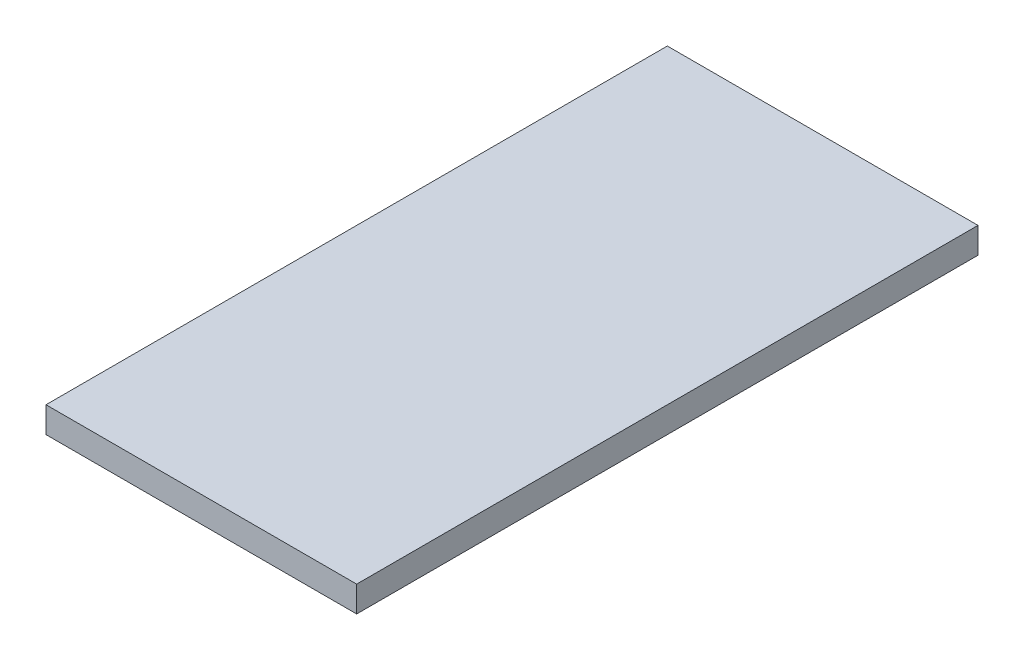
ISO-10303-21;
HEADER;
FILE_DESCRIPTION(('STEP AP214'),'2;1');
FILE_NAME('part.step','',(''),(''),'','','');
FILE_SCHEMA(('AUTOMOTIVE_DESIGN { 1 0 10303 214 1 1 1 1 }'));
ENDSEC;
DATA;
#1=APPLICATION_CONTEXT('core data for automotive mechanical design processes');
#2=APPLICATION_PROTOCOL_DEFINITION('international standard','automotive_design',2000,#1);
#3=PRODUCT_CONTEXT('',#1,'mechanical');
#4=PRODUCT('Part','Part','',(#3));
#5=PRODUCT_RELATED_PRODUCT_CATEGORY('part','',(#4));
#6=PRODUCT_DEFINITION_FORMATION('','',#4);
#7=PRODUCT_DEFINITION_CONTEXT('part definition',#1,'design');
#8=PRODUCT_DEFINITION('design','',#6,#7);
#9=PRODUCT_DEFINITION_SHAPE('','',#8);
#10=(LENGTH_UNIT() NAMED_UNIT(*) SI_UNIT(.MILLI.,.METRE.));
#11=(NAMED_UNIT(*) PLANE_ANGLE_UNIT() SI_UNIT($,.RADIAN.));
#12=(NAMED_UNIT(*) SI_UNIT($,.STERADIAN.) SOLID_ANGLE_UNIT());
#13=UNCERTAINTY_MEASURE_WITH_UNIT(LENGTH_MEASURE(1.E-05),#10,'distance_accuracy_value','');
#14=(GEOMETRIC_REPRESENTATION_CONTEXT(3) GLOBAL_UNCERTAINTY_ASSIGNED_CONTEXT((#13)) GLOBAL_UNIT_ASSIGNED_CONTEXT((#10,
#11,#12)) REPRESENTATION_CONTEXT('',''));
#15=CARTESIAN_POINT('',(0.,0.,0.));
#16=DIRECTION('',(0.,0.,1.));
#17=DIRECTION('',(1.,0.,0.));
#18=AXIS2_PLACEMENT_3D('',#15,#16,#17);
#19=CARTESIAN_POINT('',(0.,10.,0.));
#20=DIRECTION('',(1.,0.,0.));
#21=DIRECTION('',(0.,0.,-1.));
#22=AXIS2_PLACEMENT_3D('',#19,#20,#21);
#23=PLANE('',#22);
#24=DIRECTION('',(0.,0.,1.));
#25=VECTOR('',#24,1.);
#26=CARTESIAN_POINT('',(0.,0.,0.));
#27=LINE('',#26,#25);
#28=CARTESIAN_POINT('',(0.,0.,-240.));
#29=VERTEX_POINT('',#28);
#30=CARTESIAN_POINT('',(0.,0.,0.));
#31=VERTEX_POINT('',#30);
#32=EDGE_CURVE('E107',#29,#31,#27,.T.);
#33=ORIENTED_EDGE('',*,*,#32,.T.);
#34=DIRECTION('',(0.,-1.,0.));
#35=VECTOR('',#34,1.);
#36=CARTESIAN_POINT('',(0.,10.,0.));
#37=LINE('',#36,#35);
#38=CARTESIAN_POINT('',(0.,10.,0.));
#39=VERTEX_POINT('',#38);
#40=EDGE_CURVE('E11',#39,#31,#37,.T.);
#41=ORIENTED_EDGE('',*,*,#40,.F.);
#42=DIRECTION('',(0.,0.,1.));
#43=VECTOR('',#42,1.);
#44=CARTESIAN_POINT('',(0.,10.,0.));
#45=LINE('',#44,#43);
#46=CARTESIAN_POINT('',(0.,10.,-240.));
#47=VERTEX_POINT('',#46);
#48=EDGE_CURVE('E91',#47,#39,#45,.T.);
#49=ORIENTED_EDGE('',*,*,#48,.F.);
#50=DIRECTION('',(0.,-1.,0.));
#51=VECTOR('',#50,1.);
#52=CARTESIAN_POINT('',(0.,10.,-240.));
#53=LINE('',#52,#51);
#54=EDGE_CURVE('E103',#47,#29,#53,.T.);
#55=ORIENTED_EDGE('',*,*,#54,.T.);
#56=EDGE_LOOP('',(#33,#41,#49,#55));
#57=FACE_BOUND('',#56,.T.);
#58=ADVANCED_FACE('F39',(#57),#23,.F.);
#59=CARTESIAN_POINT('',(0.,10.,0.));
#60=DIRECTION('',(0.,0.,-1.));
#61=DIRECTION('',(-1.,0.,0.));
#62=AXIS2_PLACEMENT_3D('',#59,#60,#61);
#63=PLANE('',#62);
#64=DIRECTION('',(1.,0.,0.));
#65=VECTOR('',#64,1.);
#66=CARTESIAN_POINT('',(0.,0.,0.));
#67=LINE('',#66,#65);
#68=CARTESIAN_POINT('',(120.,0.,0.));
#69=VERTEX_POINT('',#68);
#70=EDGE_CURVE('E96',#31,#69,#67,.T.);
#71=ORIENTED_EDGE('',*,*,#70,.T.);
#72=DIRECTION('',(0.,-1.,0.));
#73=VECTOR('',#72,1.);
#74=CARTESIAN_POINT('',(120.,10.,0.));
#75=LINE('',#74,#73);
#76=CARTESIAN_POINT('',(120.,10.,0.));
#77=VERTEX_POINT('',#76);
#78=EDGE_CURVE('E48',#77,#69,#75,.T.);
#79=ORIENTED_EDGE('',*,*,#78,.F.);
#80=DIRECTION('',(1.,0.,0.));
#81=VECTOR('',#80,1.);
#82=CARTESIAN_POINT('',(0.,10.,0.));
#83=LINE('',#82,#81);
#84=EDGE_CURVE('E86',#39,#77,#83,.T.);
#85=ORIENTED_EDGE('',*,*,#84,.F.);
#86=ORIENTED_EDGE('',*,*,#40,.T.);
#87=EDGE_LOOP('',(#71,#79,#85,#86));
#88=FACE_BOUND('',#87,.T.);
#89=ADVANCED_FACE('F95',(#88),#63,.F.);
#90=CARTESIAN_POINT('',(120.,10.,0.));
#91=DIRECTION('',(-1.,0.,0.));
#92=DIRECTION('',(0.,0.,1.));
#93=AXIS2_PLACEMENT_3D('',#90,#91,#92);
#94=PLANE('',#93);
#95=DIRECTION('',(0.,0.,-1.));
#96=VECTOR('',#95,1.);
#97=CARTESIAN_POINT('',(120.,0.,0.));
#98=LINE('',#97,#96);
#99=CARTESIAN_POINT('',(120.,0.,-240.));
#100=VERTEX_POINT('',#99);
#101=EDGE_CURVE('E73',#69,#100,#98,.T.);
#102=ORIENTED_EDGE('',*,*,#101,.T.);
#103=DIRECTION('',(0.,-1.,0.));
#104=VECTOR('',#103,1.);
#105=CARTESIAN_POINT('',(120.,10.,-240.));
#106=LINE('',#105,#104);
#107=CARTESIAN_POINT('',(120.,10.,-240.));
#108=VERTEX_POINT('',#107);
#109=EDGE_CURVE('E98',#108,#100,#106,.T.);
#110=ORIENTED_EDGE('',*,*,#109,.F.);
#111=DIRECTION('',(0.,0.,-1.));
#112=VECTOR('',#111,1.);
#113=CARTESIAN_POINT('',(120.,10.,0.));
#114=LINE('',#113,#112);
#115=EDGE_CURVE('E89',#77,#108,#114,.T.);
#116=ORIENTED_EDGE('',*,*,#115,.F.);
#117=ORIENTED_EDGE('',*,*,#78,.T.);
#118=EDGE_LOOP('',(#102,#110,#116,#117));
#119=FACE_BOUND('',#118,.T.);
#120=ADVANCED_FACE('F99',(#119),#94,.F.);
#121=CARTESIAN_POINT('',(0.,10.,-240.));
#122=DIRECTION('',(0.,0.,1.));
#123=DIRECTION('',(1.,0.,0.));
#124=AXIS2_PLACEMENT_3D('',#121,#122,#123);
#125=PLANE('',#124);
#126=DIRECTION('',(-1.,0.,0.));
#127=VECTOR('',#126,1.);
#128=CARTESIAN_POINT('',(0.,0.,-240.));
#129=LINE('',#128,#127);
#130=EDGE_CURVE('E79',#100,#29,#129,.T.);
#131=ORIENTED_EDGE('',*,*,#130,.T.);
#132=ORIENTED_EDGE('',*,*,#54,.F.);
#133=DIRECTION('',(-1.,0.,0.));
#134=VECTOR('',#133,1.);
#135=CARTESIAN_POINT('',(0.,10.,-240.));
#136=LINE('',#135,#134);
#137=EDGE_CURVE('E56',#108,#47,#136,.T.);
#138=ORIENTED_EDGE('',*,*,#137,.F.);
#139=ORIENTED_EDGE('',*,*,#109,.T.);
#140=EDGE_LOOP('',(#131,#132,#138,#139));
#141=FACE_BOUND('',#140,.T.);
#142=ADVANCED_FACE('F120',(#141),#125,.F.);
#143=CARTESIAN_POINT('',(0.,10.,0.));
#144=DIRECTION('',(0.,-1.,0.));
#145=DIRECTION('',(0.,0.,-1.));
#146=AXIS2_PLACEMENT_3D('',#143,#144,#145);
#147=PLANE('',#146);
#148=ORIENTED_EDGE('',*,*,#48,.T.);
#149=ORIENTED_EDGE('',*,*,#84,.T.);
#150=ORIENTED_EDGE('',*,*,#115,.T.);
#151=ORIENTED_EDGE('',*,*,#137,.T.);
#152=EDGE_LOOP('',(#148,#149,#150,#151));
#153=FACE_BOUND('',#152,.T.);
#154=ADVANCED_FACE('F87',(#153),#147,.F.);
#155=CARTESIAN_POINT('',(0.,0.,0.));
#156=DIRECTION('',(0.,-1.,0.));
#157=DIRECTION('',(0.,0.,-1.));
#158=AXIS2_PLACEMENT_3D('',#155,#156,#157);
#159=PLANE('',#158);
#160=ORIENTED_EDGE('',*,*,#32,.F.);
#161=ORIENTED_EDGE('',*,*,#130,.F.);
#162=ORIENTED_EDGE('',*,*,#101,.F.);
#163=ORIENTED_EDGE('',*,*,#70,.F.);
#164=EDGE_LOOP('',(#160,#161,#162,#163));
#165=FACE_BOUND('',#164,.T.);
#166=ADVANCED_FACE('F123',(#165),#159,.T.);
#167=CLOSED_SHELL('',(#58,#89,#120,#142,#154,#166));
#168=MANIFOLD_SOLID_BREP('B2',#167);
#169=ADVANCED_BREP_SHAPE_REPRESENTATION('',(#18,#168),#14);
#170=SHAPE_DEFINITION_REPRESENTATION(#9,#169);
ENDSEC;
END-ISO-10303-21;
